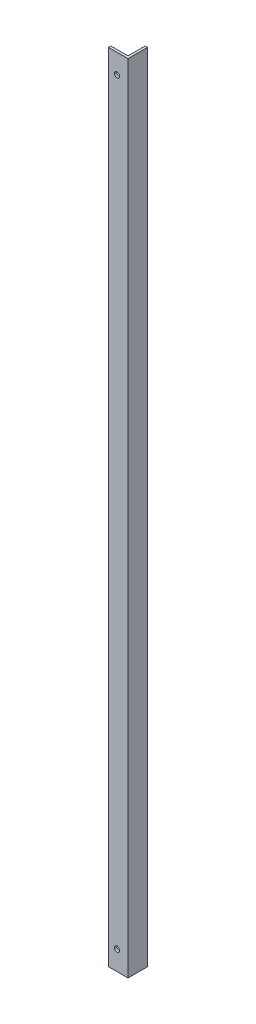
ISO-10303-21;
HEADER;
FILE_DESCRIPTION(('STEP AP214'),'2;1');
FILE_NAME('part.step','',(''),(''),'','','');
FILE_SCHEMA(('AUTOMOTIVE_DESIGN { 1 0 10303 214 1 1 1 1 }'));
ENDSEC;
DATA;
#1=APPLICATION_CONTEXT('core data for automotive mechanical design processes');
#2=APPLICATION_PROTOCOL_DEFINITION('international standard','automotive_design',2000,#1);
#3=PRODUCT_CONTEXT('',#1,'mechanical');
#4=PRODUCT('Part','Part','',(#3));
#5=PRODUCT_RELATED_PRODUCT_CATEGORY('part','',(#4));
#6=PRODUCT_DEFINITION_FORMATION('','',#4);
#7=PRODUCT_DEFINITION_CONTEXT('part definition',#1,'design');
#8=PRODUCT_DEFINITION('design','',#6,#7);
#9=PRODUCT_DEFINITION_SHAPE('','',#8);
#10=(LENGTH_UNIT() NAMED_UNIT(*) SI_UNIT(.MILLI.,.METRE.));
#11=(NAMED_UNIT(*) PLANE_ANGLE_UNIT() SI_UNIT($,.RADIAN.));
#12=(NAMED_UNIT(*) SI_UNIT($,.STERADIAN.) SOLID_ANGLE_UNIT());
#13=UNCERTAINTY_MEASURE_WITH_UNIT(LENGTH_MEASURE(1.E-05),#10,'distance_accuracy_value','');
#14=(GEOMETRIC_REPRESENTATION_CONTEXT(3) GLOBAL_UNCERTAINTY_ASSIGNED_CONTEXT((#13)) GLOBAL_UNIT_ASSIGNED_CONTEXT((#10,
#11,#12)) REPRESENTATION_CONTEXT('',''));
#15=CARTESIAN_POINT('',(0.,0.,0.));
#16=DIRECTION('',(0.,0.,1.));
#17=DIRECTION('',(1.,0.,0.));
#18=AXIS2_PLACEMENT_3D('',#15,#16,#17);
#19=CARTESIAN_POINT('',(-1314.74985259558,330.2,0.453057921452893));
#20=DIRECTION('',(0.,-1.,0.));
#21=DIRECTION('',(0.964326147917118,0.,-0.26471698178117));
#22=AXIS2_PLACEMENT_3D('',#19,#20,#21);
#23=PLANE('',#22);
#24=DIRECTION('',(1.,0.,0.));
#25=VECTOR('',#24,1.);
#26=CARTESIAN_POINT('',(-1315.75025594941,330.2,-25.3999999999994));
#27=LINE('',#26,#25);
#28=CARTESIAN_POINT('',(-1317.92485259558,330.2,-25.3999999999995));
#29=VERTEX_POINT('',#28);
#30=CARTESIAN_POINT('',(-1314.74985259558,330.2,-25.3999999999993));
#31=VERTEX_POINT('',#30);
#32=EDGE_CURVE('E194',#29,#31,#27,.T.);
#33=ORIENTED_EDGE('',*,*,#32,.T.);
#34=DIRECTION('',(0.,0.,1.));
#35=VECTOR('',#34,1.);
#36=CARTESIAN_POINT('',(-1314.74985259558,330.2,-4.83961884029349));
#37=LINE('',#36,#35);
#38=CARTESIAN_POINT('',(-1314.74985259558,330.2,1.66533453693773E-13));
#39=VERTEX_POINT('',#38);
#40=EDGE_CURVE('E141',#31,#39,#37,.T.);
#41=ORIENTED_EDGE('',*,*,#40,.T.);
#42=DIRECTION('',(-1.,0.,0.));
#43=VECTOR('',#42,1.);
#44=CARTESIAN_POINT('',(-1480.98408110292,330.2,0.));
#45=LINE('',#44,#43);
#46=CARTESIAN_POINT('',(-1340.14985259558,330.2,4.9960036108132E-13));
#47=VERTEX_POINT('',#46);
#48=EDGE_CURVE('E120',#39,#47,#45,.T.);
#49=ORIENTED_EDGE('',*,*,#48,.T.);
#50=DIRECTION('',(0.,0.,-1.));
#51=VECTOR('',#50,1.);
#52=CARTESIAN_POINT('',(-1340.14985259558,330.2,-0.889515630805637));
#53=LINE('',#52,#51);
#54=CARTESIAN_POINT('',(-1340.14985259558,330.2,-3.17499999999965));
#55=VERTEX_POINT('',#54);
#56=EDGE_CURVE('E131',#47,#55,#53,.T.);
#57=ORIENTED_EDGE('',*,*,#56,.T.);
#58=DIRECTION('',(1.,0.,0.));
#59=VECTOR('',#58,1.);
#60=CARTESIAN_POINT('',(-1336.47817261185,330.2,-3.17499999999959));
#61=LINE('',#60,#59);
#62=CARTESIAN_POINT('',(-1317.92485259558,330.2,-3.17499999999959));
#63=VERTEX_POINT('',#62);
#64=EDGE_CURVE('E137',#55,#63,#61,.T.);
#65=ORIENTED_EDGE('',*,*,#64,.T.);
#66=DIRECTION('',(0.,0.,-1.));
#67=VECTOR('',#66,1.);
#68=CARTESIAN_POINT('',(-1317.92485259558,330.2,-21.4481556932714));
#69=LINE('',#68,#67);
#70=EDGE_CURVE('E197',#63,#29,#69,.T.);
#71=ORIENTED_EDGE('',*,*,#70,.T.);
#72=EDGE_LOOP('',(#33,#41,#49,#57,#65,#71));
#73=FACE_BOUND('',#72,.T.);
#74=ADVANCED_FACE('F46',(#73),#23,.T.);
#75=CARTESIAN_POINT('',(-1314.74985259558,-3046.63179568099,-4.83961884029355));
#76=DIRECTION('',(-1.,0.,0.));
#77=DIRECTION('',(0.,0.,1.));
#78=AXIS2_PLACEMENT_3D('',#75,#76,#77);
#79=PLANE('',#78);
#80=ORIENTED_EDGE('',*,*,#40,.F.);
#81=DIRECTION('',(0.,1.,0.));
#82=VECTOR('',#81,1.);
#83=CARTESIAN_POINT('',(-1314.74985259558,-3046.63179568099,-25.3999999999994));
#84=LINE('',#83,#82);
#85=CARTESIAN_POINT('',(-1314.74985259558,1365.25,-25.3999999999994));
#86=VERTEX_POINT('',#85);
#87=EDGE_CURVE('E67',#31,#86,#84,.T.);
#88=ORIENTED_EDGE('',*,*,#87,.T.);
#89=DIRECTION('',(0.,0.,1.));
#90=VECTOR('',#89,1.);
#91=CARTESIAN_POINT('',(-1314.74985259558,1365.25,-4.83961884029355));
#92=LINE('',#91,#90);
#93=CARTESIAN_POINT('',(-1314.74985259558,1365.25,1.66533453693773E-13));
#94=VERTEX_POINT('',#93);
#95=EDGE_CURVE('E11',#86,#94,#92,.T.);
#96=ORIENTED_EDGE('',*,*,#95,.T.);
#97=DIRECTION('',(0.,1.,0.));
#98=VECTOR('',#97,1.);
#99=CARTESIAN_POINT('',(-1314.74985259558,-3046.63179568099,1.66533453693773E-13));
#100=LINE('',#99,#98);
#101=EDGE_CURVE('E127',#39,#94,#100,.T.);
#102=ORIENTED_EDGE('',*,*,#101,.F.);
#103=EDGE_LOOP('',(#80,#88,#96,#102));
#104=FACE_BOUND('',#103,.T.);
#105=ADVANCED_FACE('F211',(#104),#79,.F.);
#106=CARTESIAN_POINT('',(-1315.75025594941,-3046.63179568099,-25.3999999999994));
#107=DIRECTION('',(0.,0.,1.));
#108=DIRECTION('',(1.,0.,0.));
#109=AXIS2_PLACEMENT_3D('',#106,#107,#108);
#110=PLANE('',#109);
#111=ORIENTED_EDGE('',*,*,#32,.F.);
#112=DIRECTION('',(0.,1.,0.));
#113=VECTOR('',#112,1.);
#114=CARTESIAN_POINT('',(-1317.92485259558,-3046.63179568099,-25.3999999999995));
#115=LINE('',#114,#113);
#116=CARTESIAN_POINT('',(-1317.92485259558,1365.25,-25.3999999999995));
#117=VERTEX_POINT('',#116);
#118=EDGE_CURVE('E77',#29,#117,#115,.T.);
#119=ORIENTED_EDGE('',*,*,#118,.T.);
#120=DIRECTION('',(1.,0.,0.));
#121=VECTOR('',#120,1.);
#122=CARTESIAN_POINT('',(-1315.75025594941,1365.25,-25.3999999999993));
#123=LINE('',#122,#121);
#124=EDGE_CURVE('E56',#117,#86,#123,.T.);
#125=ORIENTED_EDGE('',*,*,#124,.T.);
#126=ORIENTED_EDGE('',*,*,#87,.F.);
#127=EDGE_LOOP('',(#111,#119,#125,#126));
#128=FACE_BOUND('',#127,.T.);
#129=ADVANCED_FACE('F209',(#128),#110,.F.);
#130=CARTESIAN_POINT('',(-1317.92485259558,-3046.63179568099,-21.4481556932714));
#131=DIRECTION('',(1.,0.,0.));
#132=DIRECTION('',(0.,0.,-1.));
#133=AXIS2_PLACEMENT_3D('',#130,#131,#132);
#134=PLANE('',#133);
#135=ORIENTED_EDGE('',*,*,#70,.F.);
#136=DIRECTION('',(0.,1.,0.));
#137=VECTOR('',#136,1.);
#138=CARTESIAN_POINT('',(-1317.92485259558,-3046.63179568099,-3.17499999999965));
#139=LINE('',#138,#137);
#140=CARTESIAN_POINT('',(-1317.92485259558,1365.25,-3.17499999999965));
#141=VERTEX_POINT('',#140);
#142=EDGE_CURVE('E158',#63,#141,#139,.T.);
#143=ORIENTED_EDGE('',*,*,#142,.T.);
#144=DIRECTION('',(0.,0.,-1.));
#145=VECTOR('',#144,1.);
#146=CARTESIAN_POINT('',(-1317.92485259558,1365.25,-21.4481556932713));
#147=LINE('',#146,#145);
#148=EDGE_CURVE('E188',#141,#117,#147,.T.);
#149=ORIENTED_EDGE('',*,*,#148,.T.);
#150=ORIENTED_EDGE('',*,*,#118,.F.);
#151=EDGE_LOOP('',(#135,#143,#149,#150));
#152=FACE_BOUND('',#151,.T.);
#153=ADVANCED_FACE('F207',(#152),#134,.F.);
#154=CARTESIAN_POINT('',(-1336.47817261185,-3046.63179568099,-3.17499999999954));
#155=DIRECTION('',(0.,0.,1.));
#156=DIRECTION('',(1.,0.,0.));
#157=AXIS2_PLACEMENT_3D('',#154,#155,#156);
#158=PLANE('',#157);
#159=CARTESIAN_POINT('',(-1329.03735259558,355.6,-3.17499999999954));
#160=DIRECTION('',(0.,0.,1.));
#161=DIRECTION('',(1.,0.,0.));
#162=AXIS2_PLACEMENT_3D('',#159,#160,#161);
#163=CIRCLE('',#162,3.3782);
#164=CARTESIAN_POINT('',(-1325.65915259558,355.6,-3.17499999999954));
#165=VERTEX_POINT('',#164);
#166=EDGE_CURVE('E166',#165,#165,#163,.F.);
#167=ORIENTED_EDGE('',*,*,#166,.F.);
#168=EDGE_LOOP('',(#167));
#169=FACE_BOUND('',#168,.T.);
#170=CARTESIAN_POINT('',(-1329.03735259558,1339.85,-3.17499999999954));
#171=DIRECTION('',(0.,0.,1.));
#172=DIRECTION('',(1.,0.,0.));
#173=AXIS2_PLACEMENT_3D('',#170,#171,#172);
#174=CIRCLE('',#173,3.3782);
#175=CARTESIAN_POINT('',(-1325.65915259558,1339.85,-3.17499999999954));
#176=VERTEX_POINT('',#175);
#177=EDGE_CURVE('E143',#176,#176,#174,.F.);
#178=ORIENTED_EDGE('',*,*,#177,.F.);
#179=EDGE_LOOP('',(#178));
#180=FACE_BOUND('',#179,.T.);
#181=ORIENTED_EDGE('',*,*,#64,.F.);
#182=DIRECTION('',(0.,1.,0.));
#183=VECTOR('',#182,1.);
#184=CARTESIAN_POINT('',(-1340.14985259558,-3046.63179568099,-3.17499999999965));
#185=LINE('',#184,#183);
#186=CARTESIAN_POINT('',(-1340.14985259558,1365.25,-3.17499999999965));
#187=VERTEX_POINT('',#186);
#188=EDGE_CURVE('E128',#55,#187,#185,.T.);
#189=ORIENTED_EDGE('',*,*,#188,.T.);
#190=DIRECTION('',(1.,0.,0.));
#191=VECTOR('',#190,1.);
#192=CARTESIAN_POINT('',(-1336.47817261185,1365.25,-3.17499999999965));
#193=LINE('',#192,#191);
#194=EDGE_CURVE('E184',#187,#141,#193,.T.);
#195=ORIENTED_EDGE('',*,*,#194,.T.);
#196=ORIENTED_EDGE('',*,*,#142,.F.);
#197=EDGE_LOOP('',(#181,#189,#195,#196));
#198=FACE_BOUND('',#197,.T.);
#199=ADVANCED_FACE('F203',(#169,#180,#198),#158,.F.);
#200=CARTESIAN_POINT('',(-1340.14985259558,-3046.63179568099,-0.889515630805637));
#201=DIRECTION('',(1.,0.,0.));
#202=DIRECTION('',(0.,0.,-1.));
#203=AXIS2_PLACEMENT_3D('',#200,#201,#202);
#204=PLANE('',#203);
#205=ORIENTED_EDGE('',*,*,#56,.F.);
#206=DIRECTION('',(0.,1.,0.));
#207=VECTOR('',#206,1.);
#208=CARTESIAN_POINT('',(-1340.14985259558,-3046.63179568099,4.9960036108132E-13));
#209=LINE('',#208,#207);
#210=CARTESIAN_POINT('',(-1340.14985259558,1365.25,4.9960036108132E-13));
#211=VERTEX_POINT('',#210);
#212=EDGE_CURVE('E117',#47,#211,#209,.T.);
#213=ORIENTED_EDGE('',*,*,#212,.T.);
#214=DIRECTION('',(0.,0.,-1.));
#215=VECTOR('',#214,1.);
#216=CARTESIAN_POINT('',(-1340.14985259558,1365.25,-0.889515630805582));
#217=LINE('',#216,#215);
#218=EDGE_CURVE('E181',#211,#187,#217,.T.);
#219=ORIENTED_EDGE('',*,*,#218,.T.);
#220=ORIENTED_EDGE('',*,*,#188,.F.);
#221=EDGE_LOOP('',(#205,#213,#219,#220));
#222=FACE_BOUND('',#221,.T.);
#223=ADVANCED_FACE('F132',(#222),#204,.F.);
#224=CARTESIAN_POINT('',(-1480.98408110292,-3046.63179568099,0.));
#225=DIRECTION('',(0.,0.,-1.));
#226=DIRECTION('',(-1.,0.,0.));
#227=AXIS2_PLACEMENT_3D('',#224,#225,#226);
#228=PLANE('',#227);
#229=CARTESIAN_POINT('',(-1329.03735259558,355.6,2.22044604925031E-13));
#230=DIRECTION('',(0.,0.,-1.));
#231=DIRECTION('',(-1.,0.,0.));
#232=AXIS2_PLACEMENT_3D('',#229,#230,#231);
#233=CIRCLE('',#232,3.3782);
#234=CARTESIAN_POINT('',(-1332.41555259558,355.6,2.20356854985226E-13));
#235=VERTEX_POINT('',#234);
#236=EDGE_CURVE('E50',#235,#235,#233,.F.);
#237=ORIENTED_EDGE('',*,*,#236,.F.);
#238=EDGE_LOOP('',(#237));
#239=FACE_BOUND('',#238,.T.);
#240=CARTESIAN_POINT('',(-1329.03735259558,1339.85,1.66533453693773E-13));
#241=DIRECTION('',(0.,0.,-1.));
#242=DIRECTION('',(-1.,0.,0.));
#243=AXIS2_PLACEMENT_3D('',#240,#241,#242);
#244=CIRCLE('',#243,3.3782);
#245=CARTESIAN_POINT('',(-1332.41555259558,1339.85,1.64845703753969E-13));
#246=VERTEX_POINT('',#245);
#247=EDGE_CURVE('E150',#246,#246,#244,.F.);
#248=ORIENTED_EDGE('',*,*,#247,.F.);
#249=EDGE_LOOP('',(#248));
#250=FACE_BOUND('',#249,.T.);
#251=ORIENTED_EDGE('',*,*,#48,.F.);
#252=ORIENTED_EDGE('',*,*,#101,.T.);
#253=DIRECTION('',(-1.,0.,0.));
#254=VECTOR('',#253,1.);
#255=CARTESIAN_POINT('',(-1480.98408110292,1365.25,0.));
#256=LINE('',#255,#254);
#257=EDGE_CURVE('E122',#94,#211,#256,.T.);
#258=ORIENTED_EDGE('',*,*,#257,.T.);
#259=ORIENTED_EDGE('',*,*,#212,.F.);
#260=EDGE_LOOP('',(#251,#252,#258,#259));
#261=FACE_BOUND('',#260,.T.);
#262=ADVANCED_FACE('F48',(#239,#250,#261),#228,.F.);
#263=CARTESIAN_POINT('',(-1476.1211207883,1365.25,11.3650697175547));
#264=DIRECTION('',(0.,1.,0.));
#265=DIRECTION('',(-0.964326147917118,0.,0.26471698178117));
#266=AXIS2_PLACEMENT_3D('',#263,#264,#265);
#267=PLANE('',#266);
#268=ORIENTED_EDGE('',*,*,#95,.F.);
#269=ORIENTED_EDGE('',*,*,#124,.F.);
#270=ORIENTED_EDGE('',*,*,#148,.F.);
#271=ORIENTED_EDGE('',*,*,#194,.F.);
#272=ORIENTED_EDGE('',*,*,#218,.F.);
#273=ORIENTED_EDGE('',*,*,#257,.F.);
#274=EDGE_LOOP('',(#268,#269,#270,#271,#272,#273));
#275=FACE_BOUND('',#274,.T.);
#276=ADVANCED_FACE('F213',(#275),#267,.T.);
#277=CARTESIAN_POINT('',(-1329.03735259558,1339.85,-3553.21699062703));
#278=DIRECTION('',(0.,0.,1.));
#279=DIRECTION('',(1.,0.,0.));
#280=AXIS2_PLACEMENT_3D('',#277,#278,#279);
#281=CYLINDRICAL_SURFACE('',#280,3.3782);
#282=ORIENTED_EDGE('',*,*,#247,.T.);
#283=EDGE_LOOP('',(#282));
#284=FACE_BOUND('',#283,.T.);
#285=ORIENTED_EDGE('',*,*,#177,.T.);
#286=EDGE_LOOP('',(#285));
#287=FACE_BOUND('',#286,.T.);
#288=ADVANCED_FACE('F215',(#284,#287),#281,.F.);
#289=CARTESIAN_POINT('',(-1329.03735259558,355.6,-3553.21699062703));
#290=DIRECTION('',(0.,0.,1.));
#291=DIRECTION('',(1.,0.,0.));
#292=AXIS2_PLACEMENT_3D('',#289,#290,#291);
#293=CYLINDRICAL_SURFACE('',#292,3.3782);
#294=ORIENTED_EDGE('',*,*,#236,.T.);
#295=EDGE_LOOP('',(#294));
#296=FACE_BOUND('',#295,.T.);
#297=ORIENTED_EDGE('',*,*,#166,.T.);
#298=EDGE_LOOP('',(#297));
#299=FACE_BOUND('',#298,.T.);
#300=ADVANCED_FACE('F221',(#296,#299),#293,.F.);
#301=CLOSED_SHELL('',(#74,#105,#129,#153,#199,#223,#262,#276,#288,#300));
#302=MANIFOLD_SOLID_BREP('B2',#301);
#303=ADVANCED_BREP_SHAPE_REPRESENTATION('',(#18,#302),#14);
#304=SHAPE_DEFINITION_REPRESENTATION(#9,#303);
ENDSEC;
END-ISO-10303-21;
